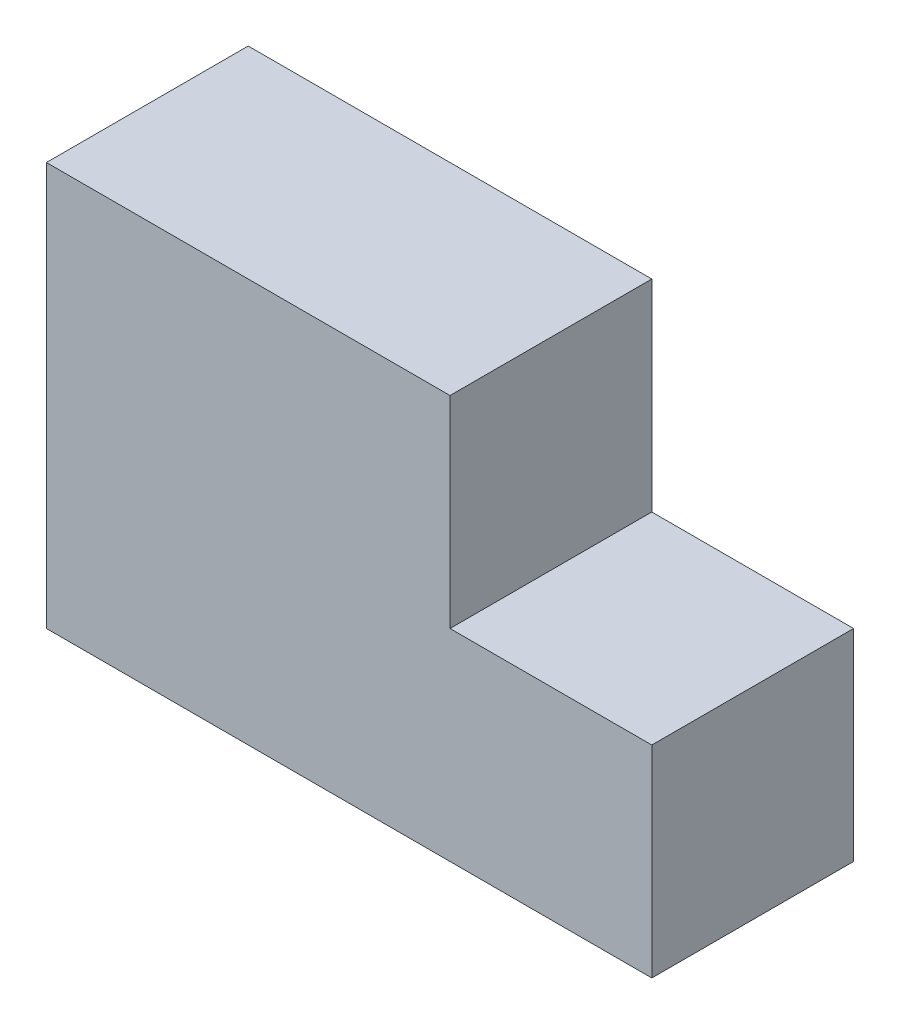
ISO-10303-21;
HEADER;
FILE_DESCRIPTION(('STEP AP214'),'2;1');
FILE_NAME('part.step','',(''),(''),'','','');
FILE_SCHEMA(('AUTOMOTIVE_DESIGN { 1 0 10303 214 1 1 1 1 }'));
ENDSEC;
DATA;
#1=APPLICATION_CONTEXT('core data for automotive mechanical design processes');
#2=APPLICATION_PROTOCOL_DEFINITION('international standard','automotive_design',2000,#1);
#3=PRODUCT_CONTEXT('',#1,'mechanical');
#4=PRODUCT('Part','Part','',(#3));
#5=PRODUCT_RELATED_PRODUCT_CATEGORY('part','',(#4));
#6=PRODUCT_DEFINITION_FORMATION('','',#4);
#7=PRODUCT_DEFINITION_CONTEXT('part definition',#1,'design');
#8=PRODUCT_DEFINITION('design','',#6,#7);
#9=PRODUCT_DEFINITION_SHAPE('','',#8);
#10=(LENGTH_UNIT() NAMED_UNIT(*) SI_UNIT(.MILLI.,.METRE.));
#11=(NAMED_UNIT(*) PLANE_ANGLE_UNIT() SI_UNIT($,.RADIAN.));
#12=(NAMED_UNIT(*) SI_UNIT($,.STERADIAN.) SOLID_ANGLE_UNIT());
#13=UNCERTAINTY_MEASURE_WITH_UNIT(LENGTH_MEASURE(1.E-05),#10,'distance_accuracy_value','');
#14=(GEOMETRIC_REPRESENTATION_CONTEXT(3) GLOBAL_UNCERTAINTY_ASSIGNED_CONTEXT((#13)) GLOBAL_UNIT_ASSIGNED_CONTEXT((#10,
#11,#12)) REPRESENTATION_CONTEXT('',''));
#15=CARTESIAN_POINT('',(0.,0.,0.));
#16=DIRECTION('',(0.,0.,1.));
#17=DIRECTION('',(1.,0.,0.));
#18=AXIS2_PLACEMENT_3D('',#15,#16,#17);
#19=CARTESIAN_POINT('',(0.,0.,25.4));
#20=DIRECTION('',(1.,0.,0.));
#21=DIRECTION('',(0.,0.,-1.));
#22=AXIS2_PLACEMENT_3D('',#19,#20,#21);
#23=PLANE('',#22);
#24=DIRECTION('',(0.,-1.,0.));
#25=VECTOR('',#24,1.);
#26=CARTESIAN_POINT('',(0.,0.,0.));
#27=LINE('',#26,#25);
#28=CARTESIAN_POINT('',(0.,50.8,0.));
#29=VERTEX_POINT('',#28);
#30=CARTESIAN_POINT('',(0.,0.,0.));
#31=VERTEX_POINT('',#30);
#32=EDGE_CURVE('E117',#29,#31,#27,.T.);
#33=ORIENTED_EDGE('',*,*,#32,.T.);
#34=DIRECTION('',(0.,0.,-1.));
#35=VECTOR('',#34,1.);
#36=CARTESIAN_POINT('',(0.,0.,25.4));
#37=LINE('',#36,#35);
#38=CARTESIAN_POINT('',(0.,0.,25.4));
#39=VERTEX_POINT('',#38);
#40=EDGE_CURVE('E11',#39,#31,#37,.T.);
#41=ORIENTED_EDGE('',*,*,#40,.F.);
#42=DIRECTION('',(0.,-1.,0.));
#43=VECTOR('',#42,1.);
#44=CARTESIAN_POINT('',(0.,0.,25.4));
#45=LINE('',#44,#43);
#46=CARTESIAN_POINT('',(0.,50.8,25.4));
#47=VERTEX_POINT('',#46);
#48=EDGE_CURVE('E127',#47,#39,#45,.T.);
#49=ORIENTED_EDGE('',*,*,#48,.F.);
#50=DIRECTION('',(0.,0.,-1.));
#51=VECTOR('',#50,1.);
#52=CARTESIAN_POINT('',(0.,50.8,25.4));
#53=LINE('',#52,#51);
#54=EDGE_CURVE('E113',#47,#29,#53,.T.);
#55=ORIENTED_EDGE('',*,*,#54,.T.);
#56=EDGE_LOOP('',(#33,#41,#49,#55));
#57=FACE_BOUND('',#56,.T.);
#58=ADVANCED_FACE('F33',(#57),#23,.F.);
#59=CARTESIAN_POINT('',(76.2,0.,25.4));
#60=DIRECTION('',(0.,1.,0.));
#61=DIRECTION('',(0.,0.,1.));
#62=AXIS2_PLACEMENT_3D('',#59,#60,#61);
#63=PLANE('',#62);
#64=DIRECTION('',(1.,0.,0.));
#65=VECTOR('',#64,1.);
#66=CARTESIAN_POINT('',(76.2,0.,0.));
#67=LINE('',#66,#65);
#68=CARTESIAN_POINT('',(76.2,0.,0.));
#69=VERTEX_POINT('',#68);
#70=EDGE_CURVE('E120',#31,#69,#67,.T.);
#71=ORIENTED_EDGE('',*,*,#70,.T.);
#72=DIRECTION('',(0.,0.,-1.));
#73=VECTOR('',#72,1.);
#74=CARTESIAN_POINT('',(76.2,0.,25.4));
#75=LINE('',#74,#73);
#76=CARTESIAN_POINT('',(76.2,0.,25.4));
#77=VERTEX_POINT('',#76);
#78=EDGE_CURVE('E41',#77,#69,#75,.T.);
#79=ORIENTED_EDGE('',*,*,#78,.F.);
#80=DIRECTION('',(1.,0.,0.));
#81=VECTOR('',#80,1.);
#82=CARTESIAN_POINT('',(76.2,0.,25.4));
#83=LINE('',#82,#81);
#84=EDGE_CURVE('E86',#39,#77,#83,.T.);
#85=ORIENTED_EDGE('',*,*,#84,.F.);
#86=ORIENTED_EDGE('',*,*,#40,.T.);
#87=EDGE_LOOP('',(#71,#79,#85,#86));
#88=FACE_BOUND('',#87,.T.);
#89=ADVANCED_FACE('F151',(#88),#63,.F.);
#90=CARTESIAN_POINT('',(76.2,25.4,25.4));
#91=DIRECTION('',(-1.,0.,0.));
#92=DIRECTION('',(0.,0.,1.));
#93=AXIS2_PLACEMENT_3D('',#90,#91,#92);
#94=PLANE('',#93);
#95=DIRECTION('',(0.,1.,0.));
#96=VECTOR('',#95,1.);
#97=CARTESIAN_POINT('',(76.2,25.4,0.));
#98=LINE('',#97,#96);
#99=CARTESIAN_POINT('',(76.2,25.4,0.));
#100=VERTEX_POINT('',#99);
#101=EDGE_CURVE('E122',#69,#100,#98,.T.);
#102=ORIENTED_EDGE('',*,*,#101,.T.);
#103=DIRECTION('',(0.,0.,-1.));
#104=VECTOR('',#103,1.);
#105=CARTESIAN_POINT('',(76.2,25.4,25.4));
#106=LINE('',#105,#104);
#107=CARTESIAN_POINT('',(76.2,25.4,25.4));
#108=VERTEX_POINT('',#107);
#109=EDGE_CURVE('E108',#108,#100,#106,.T.);
#110=ORIENTED_EDGE('',*,*,#109,.F.);
#111=DIRECTION('',(0.,1.,0.));
#112=VECTOR('',#111,1.);
#113=CARTESIAN_POINT('',(76.2,25.4,25.4));
#114=LINE('',#113,#112);
#115=EDGE_CURVE('E99',#77,#108,#114,.T.);
#116=ORIENTED_EDGE('',*,*,#115,.F.);
#117=ORIENTED_EDGE('',*,*,#78,.T.);
#118=EDGE_LOOP('',(#102,#110,#116,#117));
#119=FACE_BOUND('',#118,.T.);
#120=ADVANCED_FACE('F133',(#119),#94,.F.);
#121=CARTESIAN_POINT('',(50.8,25.4,25.4));
#122=DIRECTION('',(0.,-1.,0.));
#123=DIRECTION('',(0.,0.,-1.));
#124=AXIS2_PLACEMENT_3D('',#121,#122,#123);
#125=PLANE('',#124);
#126=DIRECTION('',(-1.,0.,0.));
#127=VECTOR('',#126,1.);
#128=CARTESIAN_POINT('',(50.8,25.4,0.));
#129=LINE('',#128,#127);
#130=CARTESIAN_POINT('',(50.8,25.4,0.));
#131=VERTEX_POINT('',#130);
#132=EDGE_CURVE('E107',#100,#131,#129,.T.);
#133=ORIENTED_EDGE('',*,*,#132,.T.);
#134=DIRECTION('',(0.,0.,-1.));
#135=VECTOR('',#134,1.);
#136=CARTESIAN_POINT('',(50.8,25.4,25.4));
#137=LINE('',#136,#135);
#138=CARTESIAN_POINT('',(50.8,25.4,25.4));
#139=VERTEX_POINT('',#138);
#140=EDGE_CURVE('E104',#139,#131,#137,.T.);
#141=ORIENTED_EDGE('',*,*,#140,.F.);
#142=DIRECTION('',(-1.,0.,0.));
#143=VECTOR('',#142,1.);
#144=CARTESIAN_POINT('',(50.8,25.4,25.4));
#145=LINE('',#144,#143);
#146=EDGE_CURVE('E93',#108,#139,#145,.T.);
#147=ORIENTED_EDGE('',*,*,#146,.F.);
#148=ORIENTED_EDGE('',*,*,#109,.T.);
#149=EDGE_LOOP('',(#133,#141,#147,#148));
#150=FACE_BOUND('',#149,.T.);
#151=ADVANCED_FACE('F105',(#150),#125,.F.);
#152=CARTESIAN_POINT('',(50.8,50.8,25.4));
#153=DIRECTION('',(-1.,0.,0.));
#154=DIRECTION('',(0.,0.,1.));
#155=AXIS2_PLACEMENT_3D('',#152,#153,#154);
#156=PLANE('',#155);
#157=DIRECTION('',(0.,1.,0.));
#158=VECTOR('',#157,1.);
#159=CARTESIAN_POINT('',(50.8,50.8,0.));
#160=LINE('',#159,#158);
#161=CARTESIAN_POINT('',(50.8,50.8,0.));
#162=VERTEX_POINT('',#161);
#163=EDGE_CURVE('E72',#131,#162,#160,.T.);
#164=ORIENTED_EDGE('',*,*,#163,.T.);
#165=DIRECTION('',(0.,0.,-1.));
#166=VECTOR('',#165,1.);
#167=CARTESIAN_POINT('',(50.8,50.8,25.4));
#168=LINE('',#167,#166);
#169=CARTESIAN_POINT('',(50.8,50.8,25.4));
#170=VERTEX_POINT('',#169);
#171=EDGE_CURVE('E109',#170,#162,#168,.T.);
#172=ORIENTED_EDGE('',*,*,#171,.F.);
#173=DIRECTION('',(0.,1.,0.));
#174=VECTOR('',#173,1.);
#175=CARTESIAN_POINT('',(50.8,50.8,25.4));
#176=LINE('',#175,#174);
#177=EDGE_CURVE('E97',#139,#170,#176,.T.);
#178=ORIENTED_EDGE('',*,*,#177,.F.);
#179=ORIENTED_EDGE('',*,*,#140,.T.);
#180=EDGE_LOOP('',(#164,#172,#178,#179));
#181=FACE_BOUND('',#180,.T.);
#182=ADVANCED_FACE('F111',(#181),#156,.F.);
#183=CARTESIAN_POINT('',(0.,50.8,25.4));
#184=DIRECTION('',(0.,-1.,0.));
#185=DIRECTION('',(0.,0.,-1.));
#186=AXIS2_PLACEMENT_3D('',#183,#184,#185);
#187=PLANE('',#186);
#188=DIRECTION('',(-1.,0.,0.));
#189=VECTOR('',#188,1.);
#190=CARTESIAN_POINT('',(0.,50.8,0.));
#191=LINE('',#190,#189);
#192=EDGE_CURVE('E78',#162,#29,#191,.T.);
#193=ORIENTED_EDGE('',*,*,#192,.T.);
#194=ORIENTED_EDGE('',*,*,#54,.F.);
#195=DIRECTION('',(-1.,0.,0.));
#196=VECTOR('',#195,1.);
#197=CARTESIAN_POINT('',(0.,50.8,25.4));
#198=LINE('',#197,#196);
#199=EDGE_CURVE('E49',#170,#47,#198,.T.);
#200=ORIENTED_EDGE('',*,*,#199,.F.);
#201=ORIENTED_EDGE('',*,*,#171,.T.);
#202=EDGE_LOOP('',(#193,#194,#200,#201));
#203=FACE_BOUND('',#202,.T.);
#204=ADVANCED_FACE('F140',(#203),#187,.F.);
#205=CARTESIAN_POINT('',(0.,0.,25.4));
#206=DIRECTION('',(0.,0.,-1.));
#207=DIRECTION('',(-1.,0.,0.));
#208=AXIS2_PLACEMENT_3D('',#205,#206,#207);
#209=PLANE('',#208);
#210=ORIENTED_EDGE('',*,*,#48,.T.);
#211=ORIENTED_EDGE('',*,*,#84,.T.);
#212=ORIENTED_EDGE('',*,*,#115,.T.);
#213=ORIENTED_EDGE('',*,*,#146,.T.);
#214=ORIENTED_EDGE('',*,*,#177,.T.);
#215=ORIENTED_EDGE('',*,*,#199,.T.);
#216=EDGE_LOOP('',(#210,#211,#212,#213,#214,#215));
#217=FACE_BOUND('',#216,.T.);
#218=ADVANCED_FACE('F95',(#217),#209,.F.);
#219=CARTESIAN_POINT('',(0.,0.,0.));
#220=DIRECTION('',(0.,0.,-1.));
#221=DIRECTION('',(-1.,0.,0.));
#222=AXIS2_PLACEMENT_3D('',#219,#220,#221);
#223=PLANE('',#222);
#224=ORIENTED_EDGE('',*,*,#32,.F.);
#225=ORIENTED_EDGE('',*,*,#192,.F.);
#226=ORIENTED_EDGE('',*,*,#163,.F.);
#227=ORIENTED_EDGE('',*,*,#132,.F.);
#228=ORIENTED_EDGE('',*,*,#101,.F.);
#229=ORIENTED_EDGE('',*,*,#70,.F.);
#230=EDGE_LOOP('',(#224,#225,#226,#227,#228,#229));
#231=FACE_BOUND('',#230,.T.);
#232=ADVANCED_FACE('F136',(#231),#223,.T.);
#233=CLOSED_SHELL('',(#58,#89,#120,#151,#182,#204,#218,#232));
#234=MANIFOLD_SOLID_BREP('B2',#233);
#235=ADVANCED_BREP_SHAPE_REPRESENTATION('',(#18,#234),#14);
#236=SHAPE_DEFINITION_REPRESENTATION(#9,#235);
ENDSEC;
END-ISO-10303-21;
